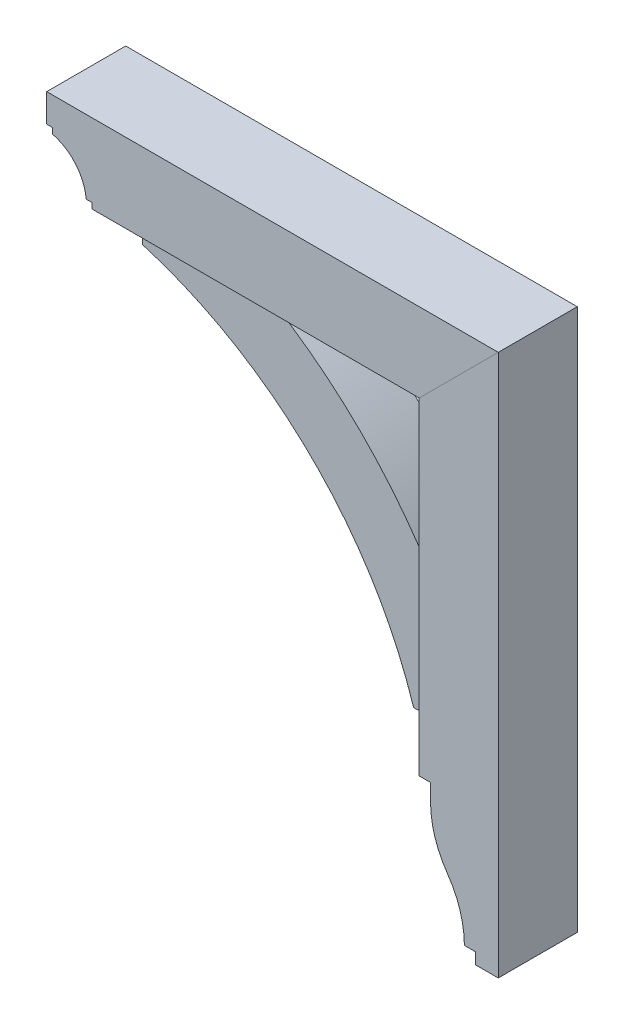
ISO-10303-21;
HEADER;
FILE_DESCRIPTION(('STEP AP214'),'2;1');
FILE_NAME('part.step','',(''),(''),'','','');
FILE_SCHEMA(('AUTOMOTIVE_DESIGN { 1 0 10303 214 1 1 1 1 }'));
ENDSEC;
DATA;
#1=APPLICATION_CONTEXT('core data for automotive mechanical design processes');
#2=APPLICATION_PROTOCOL_DEFINITION('international standard','automotive_design',2000,#1);
#3=PRODUCT_CONTEXT('',#1,'mechanical');
#4=PRODUCT('Part','Part','',(#3));
#5=PRODUCT_RELATED_PRODUCT_CATEGORY('part','',(#4));
#6=PRODUCT_DEFINITION_FORMATION('','',#4);
#7=PRODUCT_DEFINITION_CONTEXT('part definition',#1,'design');
#8=PRODUCT_DEFINITION('design','',#6,#7);
#9=PRODUCT_DEFINITION_SHAPE('','',#8);
#10=(LENGTH_UNIT() NAMED_UNIT(*) SI_UNIT(.MILLI.,.METRE.));
#11=(NAMED_UNIT(*) PLANE_ANGLE_UNIT() SI_UNIT($,.RADIAN.));
#12=(NAMED_UNIT(*) SI_UNIT($,.STERADIAN.) SOLID_ANGLE_UNIT());
#13=UNCERTAINTY_MEASURE_WITH_UNIT(LENGTH_MEASURE(1.E-05),#10,'distance_accuracy_value','');
#14=(GEOMETRIC_REPRESENTATION_CONTEXT(3) GLOBAL_UNCERTAINTY_ASSIGNED_CONTEXT((#13)) GLOBAL_UNIT_ASSIGNED_CONTEXT((#10,
#11,#12)) REPRESENTATION_CONTEXT('',''));
#15=CARTESIAN_POINT('',(0.,0.,0.));
#16=DIRECTION('',(0.,0.,1.));
#17=DIRECTION('',(1.,0.,0.));
#18=AXIS2_PLACEMENT_3D('',#15,#16,#17);
#19=CARTESIAN_POINT('',(246.881223015557,-1.43880954403931E-12,44.45));
#20=DIRECTION('',(1.,0.,0.));
#21=DIRECTION('',(0.,1.,0.));
#22=AXIS2_PLACEMENT_3D('',#19,#20,#21);
#23=PLANE('',#22);
#24=DIRECTION('',(0.,-1.,0.));
#25=VECTOR('',#24,1.);
#26=CARTESIAN_POINT('',(246.881223015557,-1.43880954403931E-12,-44.45));
#27=LINE('',#26,#25);
#28=CARTESIAN_POINT('',(246.881223015556,-183.515,-44.45));
#29=VERTEX_POINT('',#28);
#30=CARTESIAN_POINT('',(246.881223015556,-202.565,-44.45));
#31=VERTEX_POINT('',#30);
#32=EDGE_CURVE('E170',#29,#31,#27,.T.);
#33=ORIENTED_EDGE('',*,*,#32,.T.);
#34=DIRECTION('',(0.,0.,-1.));
#35=VECTOR('',#34,1.);
#36=CARTESIAN_POINT('',(246.881223015556,-202.565,44.45));
#37=LINE('',#36,#35);
#38=CARTESIAN_POINT('',(246.881223015556,-202.565,44.45));
#39=VERTEX_POINT('',#38);
#40=EDGE_CURVE('E12',#39,#31,#37,.T.);
#41=ORIENTED_EDGE('',*,*,#40,.F.);
#42=DIRECTION('',(0.,-1.,0.));
#43=VECTOR('',#42,1.);
#44=CARTESIAN_POINT('',(246.881223015557,-1.43880954403931E-12,44.45));
#45=LINE('',#44,#43);
#46=CARTESIAN_POINT('',(246.881223015556,-183.515,44.45));
#47=VERTEX_POINT('',#46);
#48=EDGE_CURVE('E203',#47,#39,#45,.T.);
#49=ORIENTED_EDGE('',*,*,#48,.F.);
#50=DIRECTION('',(0.,0.,-1.));
#51=VECTOR('',#50,1.);
#52=CARTESIAN_POINT('',(246.881223015556,-183.515,44.45));
#53=LINE('',#52,#51);
#54=EDGE_CURVE('E166',#47,#29,#53,.T.);
#55=ORIENTED_EDGE('',*,*,#54,.T.);
#56=EDGE_LOOP('',(#33,#41,#49,#55));
#57=FACE_BOUND('',#56,.T.);
#58=ADVANCED_FACE('F55',(#57),#23,.F.);
#59=CARTESIAN_POINT('',(351.656223015556,-202.565,44.45));
#60=DIRECTION('',(0.,0.,-1.));
#61=DIRECTION('',(-1.,0.,0.));
#62=AXIS2_PLACEMENT_3D('',#59,#60,#61);
#63=CYLINDRICAL_SURFACE('',#62,104.775);
#64=CARTESIAN_POINT('',(351.656223015556,-202.565,-44.45));
#65=DIRECTION('',(0.,0.,1.));
#66=DIRECTION('',(1.,0.,0.));
#67=AXIS2_PLACEMENT_3D('',#64,#65,#66);
#68=CIRCLE('',#67,104.775);
#69=CARTESIAN_POINT('',(265.883238128905,-262.738047858941,-44.45));
#70=VERTEX_POINT('',#69);
#71=EDGE_CURVE('E174',#31,#70,#68,.T.);
#72=ORIENTED_EDGE('',*,*,#71,.T.);
#73=DIRECTION('',(0.,0.,-1.));
#74=VECTOR('',#73,1.);
#75=CARTESIAN_POINT('',(265.883238128905,-262.738047858941,44.45));
#76=LINE('',#75,#74);
#77=CARTESIAN_POINT('',(265.883238128905,-262.738047858941,44.45));
#78=VERTEX_POINT('',#77);
#79=EDGE_CURVE('E64',#78,#70,#76,.T.);
#80=ORIENTED_EDGE('',*,*,#79,.F.);
#81=CARTESIAN_POINT('',(351.656223015556,-202.565,44.45));
#82=DIRECTION('',(0.,0.,1.));
#83=DIRECTION('',(1.,0.,0.));
#84=AXIS2_PLACEMENT_3D('',#81,#82,#83);
#85=CIRCLE('',#84,104.775);
#86=EDGE_CURVE('E121',#39,#78,#85,.T.);
#87=ORIENTED_EDGE('',*,*,#86,.F.);
#88=ORIENTED_EDGE('',*,*,#40,.T.);
#89=EDGE_LOOP('',(#72,#80,#87,#88));
#90=FACE_BOUND('',#89,.T.);
#91=ADVANCED_FACE('F228',(#90),#63,.T.);
#92=CARTESIAN_POINT('',(179.677056348883,-323.215,44.45));
#93=DIRECTION('',(0.,0.,-1.));
#94=DIRECTION('',(-1.,0.,0.));
#95=AXIS2_PLACEMENT_3D('',#92,#93,#94);
#96=CYLINDRICAL_SURFACE('',#95,105.304166666672);
#97=CARTESIAN_POINT('',(179.677056348883,-323.215,-44.45));
#98=DIRECTION('',(0.,0.,1.));
#99=DIRECTION('',(1.,0.,0.));
#100=AXIS2_PLACEMENT_3D('',#97,#98,#99);
#101=CIRCLE('',#100,105.304166666672);
#102=CARTESIAN_POINT('',(284.981223015555,-323.215,-44.45));
#103=VERTEX_POINT('',#102);
#104=EDGE_CURVE('E178',#103,#70,#101,.T.);
#105=ORIENTED_EDGE('',*,*,#104,.F.);
#106=DIRECTION('',(0.,0.,-1.));
#107=VECTOR('',#106,1.);
#108=CARTESIAN_POINT('',(284.981223015555,-323.215,44.45));
#109=LINE('',#108,#107);
#110=CARTESIAN_POINT('',(284.981223015555,-323.215,44.45));
#111=VERTEX_POINT('',#110);
#112=EDGE_CURVE('E219',#111,#103,#109,.T.);
#113=ORIENTED_EDGE('',*,*,#112,.F.);
#114=CARTESIAN_POINT('',(179.677056348883,-323.215,44.45));
#115=DIRECTION('',(0.,0.,1.));
#116=DIRECTION('',(1.,0.,0.));
#117=AXIS2_PLACEMENT_3D('',#114,#115,#116);
#118=CIRCLE('',#117,105.304166666672);
#119=EDGE_CURVE('E227',#111,#78,#118,.T.);
#120=ORIENTED_EDGE('',*,*,#119,.T.);
#121=ORIENTED_EDGE('',*,*,#79,.T.);
#122=EDGE_LOOP('',(#105,#113,#120,#121));
#123=FACE_BOUND('',#122,.T.);
#124=ADVANCED_FACE('F225',(#123),#96,.F.);
#125=CARTESIAN_POINT('',(0.,-323.215,44.45));
#126=DIRECTION('',(0.,-1.,0.));
#127=DIRECTION('',(0.,0.,-1.));
#128=AXIS2_PLACEMENT_3D('',#125,#126,#127);
#129=PLANE('',#128);
#130=DIRECTION('',(-1.,0.,0.));
#131=VECTOR('',#130,1.);
#132=CARTESIAN_POINT('',(0.,-323.215,-44.45));
#133=LINE('',#132,#131);
#134=CARTESIAN_POINT('',(297.681223015555,-323.215,-44.45));
#135=VERTEX_POINT('',#134);
#136=EDGE_CURVE('E182',#135,#103,#133,.T.);
#137=ORIENTED_EDGE('',*,*,#136,.F.);
#138=DIRECTION('',(0.,0.,-1.));
#139=VECTOR('',#138,1.);
#140=CARTESIAN_POINT('',(297.681223015555,-323.215,44.45));
#141=LINE('',#140,#139);
#142=CARTESIAN_POINT('',(297.681223015555,-323.215,44.45));
#143=VERTEX_POINT('',#142);
#144=EDGE_CURVE('E216',#143,#135,#141,.T.);
#145=ORIENTED_EDGE('',*,*,#144,.F.);
#146=DIRECTION('',(-1.,0.,0.));
#147=VECTOR('',#146,1.);
#148=CARTESIAN_POINT('',(0.,-323.215,44.45));
#149=LINE('',#148,#147);
#150=EDGE_CURVE('E239',#143,#111,#149,.T.);
#151=ORIENTED_EDGE('',*,*,#150,.T.);
#152=ORIENTED_EDGE('',*,*,#112,.T.);
#153=EDGE_LOOP('',(#137,#145,#151,#152));
#154=FACE_BOUND('',#153,.T.);
#155=ADVANCED_FACE('F236',(#154),#129,.T.);
#156=CARTESIAN_POINT('',(297.681223015555,0.,44.45));
#157=DIRECTION('',(-1.,0.,0.));
#158=DIRECTION('',(0.,0.,1.));
#159=AXIS2_PLACEMENT_3D('',#156,#157,#158);
#160=PLANE('',#159);
#161=DIRECTION('',(0.,1.,0.));
#162=VECTOR('',#161,1.);
#163=CARTESIAN_POINT('',(297.681223015555,0.,-44.45));
#164=LINE('',#163,#162);
#165=CARTESIAN_POINT('',(297.681223015555,-335.915,-44.45));
#166=VERTEX_POINT('',#165);
#167=EDGE_CURVE('E186',#166,#135,#164,.T.);
#168=ORIENTED_EDGE('',*,*,#167,.F.);
#169=DIRECTION('',(0.,0.,-1.));
#170=VECTOR('',#169,1.);
#171=CARTESIAN_POINT('',(297.681223015555,-335.915,44.45));
#172=LINE('',#171,#170);
#173=CARTESIAN_POINT('',(297.681223015555,-335.915,44.45));
#174=VERTEX_POINT('',#173);
#175=EDGE_CURVE('E213',#174,#166,#172,.T.);
#176=ORIENTED_EDGE('',*,*,#175,.F.);
#177=DIRECTION('',(0.,1.,0.));
#178=VECTOR('',#177,1.);
#179=CARTESIAN_POINT('',(297.681223015555,0.,44.45));
#180=LINE('',#179,#178);
#181=EDGE_CURVE('E245',#174,#143,#180,.T.);
#182=ORIENTED_EDGE('',*,*,#181,.T.);
#183=ORIENTED_EDGE('',*,*,#144,.T.);
#184=EDGE_LOOP('',(#168,#176,#182,#183));
#185=FACE_BOUND('',#184,.T.);
#186=ADVANCED_FACE('F265',(#185),#160,.T.);
#187=CARTESIAN_POINT('',(7.34134975033387E-13,-335.915000000001,44.45));
#188=DIRECTION('',(0.,-1.,0.));
#189=DIRECTION('',(1.,0.,0.));
#190=AXIS2_PLACEMENT_3D('',#187,#188,#189);
#191=PLANE('',#190);
#192=DIRECTION('',(-1.,0.,0.));
#193=VECTOR('',#192,1.);
#194=CARTESIAN_POINT('',(7.34134975033387E-13,-335.915000000001,-44.45));
#195=LINE('',#194,#193);
#196=CARTESIAN_POINT('',(323.081223015555,-335.915,-44.45));
#197=VERTEX_POINT('',#196);
#198=EDGE_CURVE('E190',#197,#166,#195,.T.);
#199=ORIENTED_EDGE('',*,*,#198,.F.);
#200=DIRECTION('',(0.,0.,-1.));
#201=VECTOR('',#200,1.);
#202=CARTESIAN_POINT('',(323.081223015555,-335.915,44.45));
#203=LINE('',#202,#201);
#204=CARTESIAN_POINT('',(323.081223015555,-335.915,44.45));
#205=VERTEX_POINT('',#204);
#206=EDGE_CURVE('E210',#205,#197,#203,.T.);
#207=ORIENTED_EDGE('',*,*,#206,.F.);
#208=DIRECTION('',(-1.,0.,0.));
#209=VECTOR('',#208,1.);
#210=CARTESIAN_POINT('',(7.34134975033387E-13,-335.915000000001,44.45));
#211=LINE('',#210,#209);
#212=EDGE_CURVE('E252',#205,#174,#211,.T.);
#213=ORIENTED_EDGE('',*,*,#212,.T.);
#214=ORIENTED_EDGE('',*,*,#175,.T.);
#215=EDGE_LOOP('',(#199,#207,#213,#214));
#216=FACE_BOUND('',#215,.T.);
#217=ADVANCED_FACE('F263',(#216),#191,.T.);
#218=CARTESIAN_POINT('',(323.081223015555,0.,44.45));
#219=DIRECTION('',(-1.,0.,0.));
#220=DIRECTION('',(0.,0.,1.));
#221=AXIS2_PLACEMENT_3D('',#218,#219,#220);
#222=PLANE('',#221);
#223=DIRECTION('',(0.,1.,0.));
#224=VECTOR('',#223,1.);
#225=CARTESIAN_POINT('',(323.081223015555,0.,-44.45));
#226=LINE('',#225,#224);
#227=CARTESIAN_POINT('',(323.081223015555,273.685,-44.45));
#228=VERTEX_POINT('',#227);
#229=EDGE_CURVE('E194',#197,#228,#226,.T.);
#230=ORIENTED_EDGE('',*,*,#229,.T.);
#231=DIRECTION('',(0.,0.,-1.));
#232=VECTOR('',#231,1.);
#233=CARTESIAN_POINT('',(323.081223015555,273.685,44.45));
#234=LINE('',#233,#232);
#235=CARTESIAN_POINT('',(323.081223015555,273.685,44.45));
#236=VERTEX_POINT('',#235);
#237=EDGE_CURVE('E158',#236,#228,#234,.T.);
#238=ORIENTED_EDGE('',*,*,#237,.F.);
#239=DIRECTION('',(0.,1.,0.));
#240=VECTOR('',#239,1.);
#241=CARTESIAN_POINT('',(323.081223015555,0.,44.45));
#242=LINE('',#241,#240);
#243=EDGE_CURVE('E147',#205,#236,#242,.T.);
#244=ORIENTED_EDGE('',*,*,#243,.F.);
#245=ORIENTED_EDGE('',*,*,#206,.T.);
#246=EDGE_LOOP('',(#230,#238,#244,#245));
#247=FACE_BOUND('',#246,.T.);
#248=ADVANCED_FACE('F272',(#247),#222,.F.);
#249=CARTESIAN_POINT('',(24.6981115077795,-24.6981115077792,44.45));
#250=DIRECTION('',(0.707106781186552,-0.707106781186543,0.));
#251=DIRECTION('',(0.707106781186543,0.707106781186552,0.));
#252=AXIS2_PLACEMENT_3D('',#249,#250,#251);
#253=PLANE('',#252);
#254=DIRECTION('',(-0.707106781186543,-0.707106781186552,0.));
#255=VECTOR('',#254,1.);
#256=CARTESIAN_POINT('',(24.6981115077795,-24.6981115077792,-44.45));
#257=LINE('',#256,#255);
#258=CARTESIAN_POINT('',(234.181223015556,184.785,-44.45));
#259=VERTEX_POINT('',#258);
#260=EDGE_CURVE('E156',#228,#259,#257,.T.);
#261=ORIENTED_EDGE('',*,*,#260,.T.);
#262=DIRECTION('',(0.,0.,-1.));
#263=VECTOR('',#262,1.);
#264=CARTESIAN_POINT('',(234.181223015556,184.785,44.45));
#265=LINE('',#264,#263);
#266=CARTESIAN_POINT('',(234.181223015556,184.785,44.45));
#267=VERTEX_POINT('',#266);
#268=EDGE_CURVE('E153',#267,#259,#265,.T.);
#269=ORIENTED_EDGE('',*,*,#268,.F.);
#270=DIRECTION('',(-0.707106781186543,-0.707106781186552,0.));
#271=VECTOR('',#270,1.);
#272=CARTESIAN_POINT('',(24.6981115077795,-24.6981115077792,44.45));
#273=LINE('',#272,#271);
#274=EDGE_CURVE('E140',#236,#267,#273,.T.);
#275=ORIENTED_EDGE('',*,*,#274,.F.);
#276=ORIENTED_EDGE('',*,*,#237,.T.);
#277=EDGE_LOOP('',(#261,#269,#275,#276));
#278=FACE_BOUND('',#277,.T.);
#279=ADVANCED_FACE('F154',(#278),#253,.F.);
#280=CARTESIAN_POINT('',(234.181223015556,0.,44.45));
#281=DIRECTION('',(1.,0.,0.));
#282=DIRECTION('',(0.,1.,0.));
#283=AXIS2_PLACEMENT_3D('',#280,#281,#282);
#284=PLANE('',#283);
#285=DIRECTION('',(0.,-1.,0.));
#286=VECTOR('',#285,1.);
#287=CARTESIAN_POINT('',(234.181223015556,0.,-44.45));
#288=LINE('',#287,#286);
#289=CARTESIAN_POINT('',(234.181223015556,-183.515,-44.45));
#290=VERTEX_POINT('',#289);
#291=EDGE_CURVE('E107',#259,#290,#288,.T.);
#292=ORIENTED_EDGE('',*,*,#291,.T.);
#293=DIRECTION('',(0.,0.,-1.));
#294=VECTOR('',#293,1.);
#295=CARTESIAN_POINT('',(234.181223015556,-183.515,44.45));
#296=LINE('',#295,#294);
#297=CARTESIAN_POINT('',(234.181223015556,-183.515,44.45));
#298=VERTEX_POINT('',#297);
#299=EDGE_CURVE('E159',#298,#290,#296,.T.);
#300=ORIENTED_EDGE('',*,*,#299,.F.);
#301=DIRECTION('',(0.,-1.,0.));
#302=VECTOR('',#301,1.);
#303=CARTESIAN_POINT('',(234.181223015556,0.,44.45));
#304=LINE('',#303,#302);
#305=EDGE_CURVE('E144',#267,#298,#304,.T.);
#306=ORIENTED_EDGE('',*,*,#305,.F.);
#307=ORIENTED_EDGE('',*,*,#268,.T.);
#308=EDGE_LOOP('',(#292,#300,#306,#307));
#309=FACE_BOUND('',#308,.T.);
#310=ADVANCED_FACE('F161',(#309),#284,.F.);
#311=CARTESIAN_POINT('',(0.,-183.515,44.45));
#312=DIRECTION('',(0.,1.,0.));
#313=DIRECTION('',(0.,0.,1.));
#314=AXIS2_PLACEMENT_3D('',#311,#312,#313);
#315=PLANE('',#314);
#316=DIRECTION('',(1.,0.,0.));
#317=VECTOR('',#316,1.);
#318=CARTESIAN_POINT('',(0.,-183.515,-44.45));
#319=LINE('',#318,#317);
#320=EDGE_CURVE('E113',#290,#29,#319,.T.);
#321=ORIENTED_EDGE('',*,*,#320,.T.);
#322=ORIENTED_EDGE('',*,*,#54,.F.);
#323=DIRECTION('',(1.,0.,0.));
#324=VECTOR('',#323,1.);
#325=CARTESIAN_POINT('',(0.,-183.515,44.45));
#326=LINE('',#325,#324);
#327=EDGE_CURVE('E72',#298,#47,#326,.T.);
#328=ORIENTED_EDGE('',*,*,#327,.F.);
#329=ORIENTED_EDGE('',*,*,#299,.T.);
#330=EDGE_LOOP('',(#321,#322,#328,#329));
#331=FACE_BOUND('',#330,.T.);
#332=ADVANCED_FACE('F317',(#331),#315,.F.);
#333=CARTESIAN_POINT('',(0.,0.,44.45));
#334=DIRECTION('',(0.,0.,1.));
#335=DIRECTION('',(1.,0.,0.));
#336=AXIS2_PLACEMENT_3D('',#333,#334,#335);
#337=PLANE('',#336);
#338=ORIENTED_EDGE('',*,*,#48,.T.);
#339=ORIENTED_EDGE('',*,*,#86,.T.);
#340=ORIENTED_EDGE('',*,*,#119,.F.);
#341=ORIENTED_EDGE('',*,*,#150,.F.);
#342=ORIENTED_EDGE('',*,*,#181,.F.);
#343=ORIENTED_EDGE('',*,*,#212,.F.);
#344=ORIENTED_EDGE('',*,*,#243,.T.);
#345=ORIENTED_EDGE('',*,*,#274,.T.);
#346=ORIENTED_EDGE('',*,*,#305,.T.);
#347=ORIENTED_EDGE('',*,*,#327,.T.);
#348=EDGE_LOOP('',(#338,#339,#340,#341,#342,#343,#344,#345,#346,#347));
#349=FACE_BOUND('',#348,.T.);
#350=ADVANCED_FACE('F142',(#349),#337,.T.);
#351=CARTESIAN_POINT('',(0.,0.,-44.45));
#352=DIRECTION('',(0.,0.,1.));
#353=DIRECTION('',(1.,0.,0.));
#354=AXIS2_PLACEMENT_3D('',#351,#352,#353);
#355=PLANE('',#354);
#356=ORIENTED_EDGE('',*,*,#32,.F.);
#357=ORIENTED_EDGE('',*,*,#320,.F.);
#358=ORIENTED_EDGE('',*,*,#291,.F.);
#359=ORIENTED_EDGE('',*,*,#260,.F.);
#360=ORIENTED_EDGE('',*,*,#229,.F.);
#361=ORIENTED_EDGE('',*,*,#198,.T.);
#362=ORIENTED_EDGE('',*,*,#167,.T.);
#363=ORIENTED_EDGE('',*,*,#136,.T.);
#364=ORIENTED_EDGE('',*,*,#104,.T.);
#365=ORIENTED_EDGE('',*,*,#71,.F.);
#366=EDGE_LOOP('',(#356,#357,#358,#359,#360,#361,#362,#363,#364,#365));
#367=FACE_BOUND('',#366,.T.);
#368=ADVANCED_FACE('F232',(#367),#355,.F.);
#369=CLOSED_SHELL('',(#58,#91,#124,#155,#186,#217,#248,#279,#310,#332,#350,#368));
#370=MANIFOLD_SOLID_BREP('B2',#369);
#371=CARTESIAN_POINT('',(-220.410616025048,-272.271107692752,31.75));
#372=DIRECTION('',(0.,0.,-1.));
#373=DIRECTION('',(-1.,0.,0.));
#374=AXIS2_PLACEMENT_3D('',#371,#372,#373);
#375=CYLINDRICAL_SURFACE('',#374,533.514492592305);
#376=CARTESIAN_POINT('',(-220.410616025048,-272.271107692752,-31.75));
#377=DIRECTION('',(0.,0.,1.));
#378=DIRECTION('',(1.,0.,0.));
#379=AXIS2_PLACEMENT_3D('',#376,#377,#378);
#380=CIRCLE('',#379,533.514492592305);
#381=CARTESIAN_POINT('',(54.7937230155559,184.785,-31.75));
#382=VERTEX_POINT('',#381);
#383=CARTESIAN_POINT('',(234.181223015556,6.98499999999996,-31.75));
#384=VERTEX_POINT('',#383);
#385=EDGE_CURVE('E474',#382,#384,#380,.F.);
#386=ORIENTED_EDGE('',*,*,#385,.F.);
#387=DIRECTION('',(0.,0.,-1.));
#388=VECTOR('',#387,1.);
#389=CARTESIAN_POINT('',(54.7937230155559,184.785,31.75));
#390=LINE('',#389,#388);
#391=CARTESIAN_POINT('',(54.7937230155559,184.785,31.75));
#392=VERTEX_POINT('',#391);
#393=EDGE_CURVE('E53',#392,#382,#390,.T.);
#394=ORIENTED_EDGE('',*,*,#393,.F.);
#395=CARTESIAN_POINT('',(-220.410616025048,-272.271107692752,31.75));
#396=DIRECTION('',(0.,0.,1.));
#397=DIRECTION('',(1.,0.,0.));
#398=AXIS2_PLACEMENT_3D('',#395,#396,#397);
#399=CIRCLE('',#398,533.514492592305);
#400=CARTESIAN_POINT('',(234.181223015556,6.98499999999996,31.75));
#401=VERTEX_POINT('',#400);
#402=EDGE_CURVE('E492',#392,#401,#399,.F.);
#403=ORIENTED_EDGE('',*,*,#402,.T.);
#404=DIRECTION('',(0.,0.,-1.));
#405=VECTOR('',#404,1.);
#406=CARTESIAN_POINT('',(234.181223015556,6.98499999999996,31.75));
#407=LINE('',#406,#405);
#408=EDGE_CURVE('E402',#401,#384,#407,.T.);
#409=ORIENTED_EDGE('',*,*,#408,.T.);
#410=EDGE_LOOP('',(#386,#394,#403,#409));
#411=FACE_BOUND('',#410,.T.);
#412=ADVANCED_FACE('F385',(#411),#375,.T.);
#413=CARTESIAN_POINT('',(0.,184.785,31.75));
#414=DIRECTION('',(0.,1.,0.));
#415=DIRECTION('',(0.,0.,1.));
#416=AXIS2_PLACEMENT_3D('',#413,#414,#415);
#417=PLANE('',#416);
#418=DIRECTION('',(1.,0.,0.));
#419=VECTOR('',#418,1.);
#420=CARTESIAN_POINT('',(0.,184.785,-31.75));
#421=LINE('',#420,#419);
#422=CARTESIAN_POINT('',(-89.6687769844451,184.785,-31.75));
#423=VERTEX_POINT('',#422);
#424=EDGE_CURVE('E477',#423,#382,#421,.T.);
#425=ORIENTED_EDGE('',*,*,#424,.F.);
#426=DIRECTION('',(0.,0.,-1.));
#427=VECTOR('',#426,1.);
#428=CARTESIAN_POINT('',(-89.6687769844451,184.785,31.75));
#429=LINE('',#428,#427);
#430=CARTESIAN_POINT('',(-89.6687769844451,184.785,31.75));
#431=VERTEX_POINT('',#430);
#432=EDGE_CURVE('E394',#431,#423,#429,.T.);
#433=ORIENTED_EDGE('',*,*,#432,.F.);
#434=DIRECTION('',(1.,0.,0.));
#435=VECTOR('',#434,1.);
#436=CARTESIAN_POINT('',(0.,184.785,31.75));
#437=LINE('',#436,#435);
#438=EDGE_CURVE('E508',#431,#392,#437,.T.);
#439=ORIENTED_EDGE('',*,*,#438,.T.);
#440=ORIENTED_EDGE('',*,*,#393,.T.);
#441=EDGE_LOOP('',(#425,#433,#439,#440));
#442=FACE_BOUND('',#441,.T.);
#443=ADVANCED_FACE('F507',(#442),#417,.T.);
#444=CARTESIAN_POINT('',(-89.6687769844453,0.,31.75));
#445=DIRECTION('',(1.,0.,0.));
#446=DIRECTION('',(0.,1.,0.));
#447=AXIS2_PLACEMENT_3D('',#444,#445,#446);
#448=PLANE('',#447);
#449=DIRECTION('',(0.,-1.,0.));
#450=VECTOR('',#449,1.);
#451=CARTESIAN_POINT('',(-89.6687769844453,0.,-31.75));
#452=LINE('',#451,#450);
#453=CARTESIAN_POINT('',(-89.6687769844452,165.735,-31.75));
#454=VERTEX_POINT('',#453);
#455=EDGE_CURVE('E481',#423,#454,#452,.T.);
#456=ORIENTED_EDGE('',*,*,#455,.T.);
#457=DIRECTION('',(0.,0.,-1.));
#458=VECTOR('',#457,1.);
#459=CARTESIAN_POINT('',(-89.6687769844452,165.735,31.75));
#460=LINE('',#459,#458);
#461=CARTESIAN_POINT('',(-89.6687769844452,165.735,31.75));
#462=VERTEX_POINT('',#461);
#463=EDGE_CURVE('E462',#462,#454,#460,.T.);
#464=ORIENTED_EDGE('',*,*,#463,.F.);
#465=DIRECTION('',(0.,-1.,0.));
#466=VECTOR('',#465,1.);
#467=CARTESIAN_POINT('',(-89.6687769844453,0.,31.75));
#468=LINE('',#467,#466);
#469=EDGE_CURVE('E448',#431,#462,#468,.T.);
#470=ORIENTED_EDGE('',*,*,#469,.F.);
#471=ORIENTED_EDGE('',*,*,#432,.T.);
#472=EDGE_LOOP('',(#456,#464,#470,#471));
#473=FACE_BOUND('',#472,.T.);
#474=ADVANCED_FACE('F501',(#473),#448,.F.);
#475=CARTESIAN_POINT('',(-220.195848850223,-272.436796799094,31.75));
#476=DIRECTION('',(0.,0.,-1.));
#477=DIRECTION('',(-1.,0.,0.));
#478=AXIS2_PLACEMENT_3D('',#475,#476,#477);
#479=CYLINDRICAL_SURFACE('',#478,457.2);
#480=CARTESIAN_POINT('',(-220.195848850223,-272.436796799094,-31.75));
#481=DIRECTION('',(0.,0.,1.));
#482=DIRECTION('',(1.,0.,0.));
#483=AXIS2_PLACEMENT_3D('',#480,#481,#482);
#484=CIRCLE('',#483,457.2);
#485=CARTESIAN_POINT('',(215.131223015556,-132.715,-31.75));
#486=VERTEX_POINT('',#485);
#487=EDGE_CURVE('E458',#454,#486,#484,.F.);
#488=ORIENTED_EDGE('',*,*,#487,.T.);
#489=DIRECTION('',(0.,0.,-1.));
#490=VECTOR('',#489,1.);
#491=CARTESIAN_POINT('',(215.131223015556,-132.715,31.75));
#492=LINE('',#491,#490);
#493=CARTESIAN_POINT('',(215.131223015556,-132.715,31.75));
#494=VERTEX_POINT('',#493);
#495=EDGE_CURVE('E455',#494,#486,#492,.T.);
#496=ORIENTED_EDGE('',*,*,#495,.F.);
#497=CARTESIAN_POINT('',(-220.195848850223,-272.436796799094,31.75));
#498=DIRECTION('',(0.,0.,1.));
#499=DIRECTION('',(1.,0.,0.));
#500=AXIS2_PLACEMENT_3D('',#497,#498,#499);
#501=CIRCLE('',#500,457.2);
#502=EDGE_CURVE('E440',#462,#494,#501,.F.);
#503=ORIENTED_EDGE('',*,*,#502,.F.);
#504=ORIENTED_EDGE('',*,*,#463,.T.);
#505=EDGE_LOOP('',(#488,#496,#503,#504));
#506=FACE_BOUND('',#505,.T.);
#507=ADVANCED_FACE('F456',(#506),#479,.F.);
#508=CARTESIAN_POINT('',(0.,-132.715,31.75));
#509=DIRECTION('',(0.,-1.,0.));
#510=DIRECTION('',(0.,0.,-1.));
#511=AXIS2_PLACEMENT_3D('',#508,#509,#510);
#512=PLANE('',#511);
#513=DIRECTION('',(-1.,0.,0.));
#514=VECTOR('',#513,1.);
#515=CARTESIAN_POINT('',(0.,-132.715,-31.75));
#516=LINE('',#515,#514);
#517=CARTESIAN_POINT('',(234.181223015556,-132.715,-31.75));
#518=VERTEX_POINT('',#517);
#519=EDGE_CURVE('E485',#518,#486,#516,.T.);
#520=ORIENTED_EDGE('',*,*,#519,.F.);
#521=DIRECTION('',(0.,0.,-1.));
#522=VECTOR('',#521,1.);
#523=CARTESIAN_POINT('',(234.181223015556,-132.715,31.75));
#524=LINE('',#523,#522);
#525=CARTESIAN_POINT('',(234.181223015556,-132.715,31.75));
#526=VERTEX_POINT('',#525);
#527=EDGE_CURVE('E421',#526,#518,#524,.T.);
#528=ORIENTED_EDGE('',*,*,#527,.F.);
#529=DIRECTION('',(-1.,0.,0.));
#530=VECTOR('',#529,1.);
#531=CARTESIAN_POINT('',(0.,-132.715,31.75));
#532=LINE('',#531,#530);
#533=EDGE_CURVE('E445',#526,#494,#532,.T.);
#534=ORIENTED_EDGE('',*,*,#533,.T.);
#535=ORIENTED_EDGE('',*,*,#495,.T.);
#536=EDGE_LOOP('',(#520,#528,#534,#535));
#537=FACE_BOUND('',#536,.T.);
#538=ADVANCED_FACE('F464',(#537),#512,.T.);
#539=CARTESIAN_POINT('',(234.181223015556,0.,31.75));
#540=DIRECTION('',(1.,0.,0.));
#541=DIRECTION('',(0.,1.,0.));
#542=AXIS2_PLACEMENT_3D('',#539,#540,#541);
#543=PLANE('',#542);
#544=DIRECTION('',(0.,-1.,0.));
#545=VECTOR('',#544,1.);
#546=CARTESIAN_POINT('',(234.181223015556,0.,-31.75));
#547=LINE('',#546,#545);
#548=EDGE_CURVE('E488',#384,#518,#547,.T.);
#549=ORIENTED_EDGE('',*,*,#548,.F.);
#550=ORIENTED_EDGE('',*,*,#408,.F.);
#551=DIRECTION('',(0.,-1.,0.));
#552=VECTOR('',#551,1.);
#553=CARTESIAN_POINT('',(234.181223015556,0.,31.75));
#554=LINE('',#553,#552);
#555=EDGE_CURVE('E466',#401,#526,#554,.T.);
#556=ORIENTED_EDGE('',*,*,#555,.T.);
#557=ORIENTED_EDGE('',*,*,#527,.T.);
#558=EDGE_LOOP('',(#549,#550,#556,#557));
#559=FACE_BOUND('',#558,.T.);
#560=ADVANCED_FACE('F509',(#559),#543,.T.);
#561=CARTESIAN_POINT('',(0.,0.,31.75));
#562=DIRECTION('',(0.,0.,1.));
#563=DIRECTION('',(1.,0.,0.));
#564=AXIS2_PLACEMENT_3D('',#561,#562,#563);
#565=PLANE('',#564);
#566=ORIENTED_EDGE('',*,*,#402,.F.);
#567=ORIENTED_EDGE('',*,*,#438,.F.);
#568=ORIENTED_EDGE('',*,*,#469,.T.);
#569=ORIENTED_EDGE('',*,*,#502,.T.);
#570=ORIENTED_EDGE('',*,*,#533,.F.);
#571=ORIENTED_EDGE('',*,*,#555,.F.);
#572=EDGE_LOOP('',(#566,#567,#568,#569,#570,#571));
#573=FACE_BOUND('',#572,.T.);
#574=ADVANCED_FACE('F442',(#573),#565,.T.);
#575=CARTESIAN_POINT('',(0.,0.,-31.75));
#576=DIRECTION('',(0.,0.,1.));
#577=DIRECTION('',(1.,0.,0.));
#578=AXIS2_PLACEMENT_3D('',#575,#576,#577);
#579=PLANE('',#578);
#580=ORIENTED_EDGE('',*,*,#385,.T.);
#581=ORIENTED_EDGE('',*,*,#548,.T.);
#582=ORIENTED_EDGE('',*,*,#519,.T.);
#583=ORIENTED_EDGE('',*,*,#487,.F.);
#584=ORIENTED_EDGE('',*,*,#455,.F.);
#585=ORIENTED_EDGE('',*,*,#424,.T.);
#586=EDGE_LOOP('',(#580,#581,#582,#583,#584,#585));
#587=FACE_BOUND('',#586,.T.);
#588=ADVANCED_FACE('F506',(#587),#579,.F.);
#589=CLOSED_SHELL('',(#412,#443,#474,#507,#538,#560,#574,#588));
#590=MANIFOLD_SOLID_BREP('B6',#589);
#591=CARTESIAN_POINT('',(-178.568776984445,0.,44.45));
#592=DIRECTION('',(-1.,0.,0.));
#593=DIRECTION('',(0.,0.,1.));
#594=AXIS2_PLACEMENT_3D('',#591,#592,#593);
#595=PLANE('',#594);
#596=DIRECTION('',(0.,1.,0.));
#597=VECTOR('',#596,1.);
#598=CARTESIAN_POINT('',(-178.568776984445,0.,-44.45));
#599=LINE('',#598,#597);
#600=CARTESIAN_POINT('',(-178.568776984445,235.585,-44.45));
#601=VERTEX_POINT('',#600);
#602=CARTESIAN_POINT('',(-178.568776984445,241.935,-44.45));
#603=VERTEX_POINT('',#602);
#604=EDGE_CURVE('E692',#601,#603,#599,.T.);
#605=ORIENTED_EDGE('',*,*,#604,.F.);
#606=DIRECTION('',(0.,0.,-1.));
#607=VECTOR('',#606,1.);
#608=CARTESIAN_POINT('',(-178.568776984445,235.585,44.45));
#609=LINE('',#608,#607);
#610=CARTESIAN_POINT('',(-178.568776984445,235.585,44.45));
#611=VERTEX_POINT('',#610);
#612=EDGE_CURVE('E383',#611,#601,#609,.T.);
#613=ORIENTED_EDGE('',*,*,#612,.F.);
#614=DIRECTION('',(0.,1.,0.));
#615=VECTOR('',#614,1.);
#616=CARTESIAN_POINT('',(-178.568776984445,0.,44.45));
#617=LINE('',#616,#615);
#618=CARTESIAN_POINT('',(-178.568776984445,241.935,44.45));
#619=VERTEX_POINT('',#618);
#620=EDGE_CURVE('E724',#611,#619,#617,.T.);
#621=ORIENTED_EDGE('',*,*,#620,.T.);
#622=DIRECTION('',(0.,0.,-1.));
#623=VECTOR('',#622,1.);
#624=CARTESIAN_POINT('',(-178.568776984445,241.935,44.45));
#625=LINE('',#624,#623);
#626=EDGE_CURVE('E603',#619,#603,#625,.T.);
#627=ORIENTED_EDGE('',*,*,#626,.T.);
#628=EDGE_LOOP('',(#605,#613,#621,#627));
#629=FACE_BOUND('',#628,.T.);
#630=ADVANCED_FACE('F586',(#629),#595,.T.);
#631=CARTESIAN_POINT('',(-190.980101736884,186.393150212196,44.45));
#632=DIRECTION('',(0.,0.,-1.));
#633=DIRECTION('',(-1.,0.,0.));
#634=AXIS2_PLACEMENT_3D('',#631,#632,#633);
#635=CYLINDRICAL_SURFACE('',#634,50.7334117486338);
#636=CARTESIAN_POINT('',(-190.980101736884,186.393150212196,-44.45));
#637=DIRECTION('',(0.,0.,1.));
#638=DIRECTION('',(1.,0.,0.));
#639=AXIS2_PLACEMENT_3D('',#636,#637,#638);
#640=CIRCLE('',#639,50.7334117486338);
#641=CARTESIAN_POINT('',(-140.468776984445,191.135,-44.45));
#642=VERTEX_POINT('',#641);
#643=EDGE_CURVE('E695',#601,#642,#640,.F.);
#644=ORIENTED_EDGE('',*,*,#643,.T.);
#645=DIRECTION('',(0.,0.,-1.));
#646=VECTOR('',#645,1.);
#647=CARTESIAN_POINT('',(-140.468776984445,191.135,44.45));
#648=LINE('',#647,#646);
#649=CARTESIAN_POINT('',(-140.468776984445,191.135,44.45));
#650=VERTEX_POINT('',#649);
#651=EDGE_CURVE('E595',#650,#642,#648,.T.);
#652=ORIENTED_EDGE('',*,*,#651,.F.);
#653=CARTESIAN_POINT('',(-190.980101736884,186.393150212196,44.45));
#654=DIRECTION('',(0.,0.,1.));
#655=DIRECTION('',(1.,0.,0.));
#656=AXIS2_PLACEMENT_3D('',#653,#654,#655);
#657=CIRCLE('',#656,50.7334117486338);
#658=EDGE_CURVE('E759',#611,#650,#657,.F.);
#659=ORIENTED_EDGE('',*,*,#658,.F.);
#660=ORIENTED_EDGE('',*,*,#612,.T.);
#661=EDGE_LOOP('',(#644,#652,#659,#660));
#662=FACE_BOUND('',#661,.T.);
#663=ADVANCED_FACE('F748',(#662),#635,.F.);
#664=CARTESIAN_POINT('',(-1.67088565206086E-12,191.135000000001,44.45));
#665=DIRECTION('',(0.,-1.,0.));
#666=DIRECTION('',(1.,0.,0.));
#667=AXIS2_PLACEMENT_3D('',#664,#665,#666);
#668=PLANE('',#667);
#669=DIRECTION('',(-1.,0.,0.));
#670=VECTOR('',#669,1.);
#671=CARTESIAN_POINT('',(-1.67088565206086E-12,191.135000000001,-44.45));
#672=LINE('',#671,#670);
#673=CARTESIAN_POINT('',(-134.118776984445,191.135,-44.45));
#674=VERTEX_POINT('',#673);
#675=EDGE_CURVE('E699',#674,#642,#672,.T.);
#676=ORIENTED_EDGE('',*,*,#675,.F.);
#677=DIRECTION('',(0.,0.,-1.));
#678=VECTOR('',#677,1.);
#679=CARTESIAN_POINT('',(-134.118776984445,191.135,44.45));
#680=LINE('',#679,#678);
#681=CARTESIAN_POINT('',(-134.118776984445,191.135,44.45));
#682=VERTEX_POINT('',#681);
#683=EDGE_CURVE('E737',#682,#674,#680,.T.);
#684=ORIENTED_EDGE('',*,*,#683,.F.);
#685=DIRECTION('',(-1.,0.,0.));
#686=VECTOR('',#685,1.);
#687=CARTESIAN_POINT('',(-1.67088565206086E-12,191.135000000001,44.45));
#688=LINE('',#687,#686);
#689=EDGE_CURVE('E745',#682,#650,#688,.T.);
#690=ORIENTED_EDGE('',*,*,#689,.T.);
#691=ORIENTED_EDGE('',*,*,#651,.T.);
#692=EDGE_LOOP('',(#676,#684,#690,#691));
#693=FACE_BOUND('',#692,.T.);
#694=ADVANCED_FACE('F743',(#693),#668,.T.);
#695=CARTESIAN_POINT('',(-134.118776984445,0.,44.45));
#696=DIRECTION('',(-1.,0.,0.));
#697=DIRECTION('',(0.,0.,1.));
#698=AXIS2_PLACEMENT_3D('',#695,#696,#697);
#699=PLANE('',#698);
#700=DIRECTION('',(0.,1.,0.));
#701=VECTOR('',#700,1.);
#702=CARTESIAN_POINT('',(-134.118776984445,0.,-44.45));
#703=LINE('',#702,#701);
#704=CARTESIAN_POINT('',(-134.118776984445,184.785,-44.45));
#705=VERTEX_POINT('',#704);
#706=EDGE_CURVE('E703',#705,#674,#703,.T.);
#707=ORIENTED_EDGE('',*,*,#706,.F.);
#708=DIRECTION('',(0.,0.,-1.));
#709=VECTOR('',#708,1.);
#710=CARTESIAN_POINT('',(-134.118776984445,184.785,44.45));
#711=LINE('',#710,#709);
#712=CARTESIAN_POINT('',(-134.118776984445,184.785,44.45));
#713=VERTEX_POINT('',#712);
#714=EDGE_CURVE('E734',#713,#705,#711,.T.);
#715=ORIENTED_EDGE('',*,*,#714,.F.);
#716=DIRECTION('',(0.,1.,0.));
#717=VECTOR('',#716,1.);
#718=CARTESIAN_POINT('',(-134.118776984445,0.,44.45));
#719=LINE('',#718,#717);
#720=EDGE_CURVE('E758',#713,#682,#719,.T.);
#721=ORIENTED_EDGE('',*,*,#720,.T.);
#722=ORIENTED_EDGE('',*,*,#683,.T.);
#723=EDGE_LOOP('',(#707,#715,#721,#722));
#724=FACE_BOUND('',#723,.T.);
#725=ADVANCED_FACE('F754',(#724),#699,.T.);
#726=CARTESIAN_POINT('',(0.,184.785,44.45));
#727=DIRECTION('',(0.,1.,0.));
#728=DIRECTION('',(0.,0.,1.));
#729=AXIS2_PLACEMENT_3D('',#726,#727,#728);
#730=PLANE('',#729);
#731=DIRECTION('',(1.,0.,0.));
#732=VECTOR('',#731,1.);
#733=CARTESIAN_POINT('',(0.,184.785,-44.45));
#734=LINE('',#733,#732);
#735=CARTESIAN_POINT('',(234.181223015556,184.785,-44.45));
#736=VERTEX_POINT('',#735);
#737=EDGE_CURVE('E707',#705,#736,#734,.T.);
#738=ORIENTED_EDGE('',*,*,#737,.T.);
#739=DIRECTION('',(0.,0.,-1.));
#740=VECTOR('',#739,1.);
#741=CARTESIAN_POINT('',(234.181223015556,184.785,44.45));
#742=LINE('',#741,#740);
#743=CARTESIAN_POINT('',(234.181223015556,184.785,44.45));
#744=VERTEX_POINT('',#743);
#745=EDGE_CURVE('E731',#744,#736,#742,.T.);
#746=ORIENTED_EDGE('',*,*,#745,.F.);
#747=DIRECTION('',(1.,0.,0.));
#748=VECTOR('',#747,1.);
#749=CARTESIAN_POINT('',(0.,184.785,44.45));
#750=LINE('',#749,#748);
#751=EDGE_CURVE('E762',#713,#744,#750,.T.);
#752=ORIENTED_EDGE('',*,*,#751,.F.);
#753=ORIENTED_EDGE('',*,*,#714,.T.);
#754=EDGE_LOOP('',(#738,#746,#752,#753));
#755=FACE_BOUND('',#754,.T.);
#756=ADVANCED_FACE('F795',(#755),#730,.F.);
#757=CARTESIAN_POINT('',(24.6981115077795,-24.6981115077792,44.45));
#758=DIRECTION('',(0.707106781186552,-0.707106781186543,0.));
#759=DIRECTION('',(0.707106781186543,0.707106781186552,0.));
#760=AXIS2_PLACEMENT_3D('',#757,#758,#759);
#761=PLANE('',#760);
#762=DIRECTION('',(-0.707106781186543,-0.707106781186552,0.));
#763=VECTOR('',#762,1.);
#764=CARTESIAN_POINT('',(24.6981115077795,-24.6981115077792,-44.45));
#765=LINE('',#764,#763);
#766=CARTESIAN_POINT('',(323.081223015555,273.685,-44.45));
#767=VERTEX_POINT('',#766);
#768=EDGE_CURVE('E711',#767,#736,#765,.T.);
#769=ORIENTED_EDGE('',*,*,#768,.F.);
#770=DIRECTION('',(0.,0.,-1.));
#771=VECTOR('',#770,1.);
#772=CARTESIAN_POINT('',(323.081223015555,273.685,44.45));
#773=LINE('',#772,#771);
#774=CARTESIAN_POINT('',(323.081223015555,273.685,44.45));
#775=VERTEX_POINT('',#774);
#776=EDGE_CURVE('E680',#775,#767,#773,.T.);
#777=ORIENTED_EDGE('',*,*,#776,.F.);
#778=DIRECTION('',(-0.707106781186543,-0.707106781186552,0.));
#779=VECTOR('',#778,1.);
#780=CARTESIAN_POINT('',(24.6981115077795,-24.6981115077792,44.45));
#781=LINE('',#780,#779);
#782=EDGE_CURVE('E668',#775,#744,#781,.T.);
#783=ORIENTED_EDGE('',*,*,#782,.T.);
#784=ORIENTED_EDGE('',*,*,#745,.T.);
#785=EDGE_LOOP('',(#769,#777,#783,#784));
#786=FACE_BOUND('',#785,.T.);
#787=ADVANCED_FACE('F772',(#786),#761,.T.);
#788=CARTESIAN_POINT('',(0.,273.685,44.45));
#789=DIRECTION('',(0.,-1.,0.));
#790=DIRECTION('',(0.,0.,-1.));
#791=AXIS2_PLACEMENT_3D('',#788,#789,#790);
#792=PLANE('',#791);
#793=DIRECTION('',(-1.,0.,0.));
#794=VECTOR('',#793,1.);
#795=CARTESIAN_POINT('',(0.,273.685,-44.45));
#796=LINE('',#795,#794);
#797=CARTESIAN_POINT('',(-184.918776984445,273.685,-44.45));
#798=VERTEX_POINT('',#797);
#799=EDGE_CURVE('E676',#767,#798,#796,.T.);
#800=ORIENTED_EDGE('',*,*,#799,.T.);
#801=DIRECTION('',(0.,0.,-1.));
#802=VECTOR('',#801,1.);
#803=CARTESIAN_POINT('',(-184.918776984445,273.685,44.45));
#804=LINE('',#803,#802);
#805=CARTESIAN_POINT('',(-184.918776984445,273.685,44.45));
#806=VERTEX_POINT('',#805);
#807=EDGE_CURVE('E673',#806,#798,#804,.T.);
#808=ORIENTED_EDGE('',*,*,#807,.F.);
#809=DIRECTION('',(-1.,0.,0.));
#810=VECTOR('',#809,1.);
#811=CARTESIAN_POINT('',(0.,273.685,44.45));
#812=LINE('',#811,#810);
#813=EDGE_CURVE('E660',#775,#806,#812,.T.);
#814=ORIENTED_EDGE('',*,*,#813,.F.);
#815=ORIENTED_EDGE('',*,*,#776,.T.);
#816=EDGE_LOOP('',(#800,#808,#814,#815));
#817=FACE_BOUND('',#816,.T.);
#818=ADVANCED_FACE('F674',(#817),#792,.F.);
#819=CARTESIAN_POINT('',(-184.918776984445,0.,44.45));
#820=DIRECTION('',(1.,0.,0.));
#821=DIRECTION('',(0.,0.,-1.));
#822=AXIS2_PLACEMENT_3D('',#819,#820,#821);
#823=PLANE('',#822);
#824=DIRECTION('',(0.,-1.,0.));
#825=VECTOR('',#824,1.);
#826=CARTESIAN_POINT('',(-184.918776984445,0.,-44.45));
#827=LINE('',#826,#825);
#828=CARTESIAN_POINT('',(-184.918776984445,241.935,-44.45));
#829=VERTEX_POINT('',#828);
#830=EDGE_CURVE('E717',#798,#829,#827,.T.);
#831=ORIENTED_EDGE('',*,*,#830,.T.);
#832=DIRECTION('',(0.,0.,-1.));
#833=VECTOR('',#832,1.);
#834=CARTESIAN_POINT('',(-184.918776984445,241.935,44.45));
#835=LINE('',#834,#833);
#836=CARTESIAN_POINT('',(-184.918776984445,241.935,44.45));
#837=VERTEX_POINT('',#836);
#838=EDGE_CURVE('E632',#837,#829,#835,.T.);
#839=ORIENTED_EDGE('',*,*,#838,.F.);
#840=DIRECTION('',(0.,-1.,0.));
#841=VECTOR('',#840,1.);
#842=CARTESIAN_POINT('',(-184.918776984445,0.,44.45));
#843=LINE('',#842,#841);
#844=EDGE_CURVE('E666',#806,#837,#843,.T.);
#845=ORIENTED_EDGE('',*,*,#844,.F.);
#846=ORIENTED_EDGE('',*,*,#807,.T.);
#847=EDGE_LOOP('',(#831,#839,#845,#846));
#848=FACE_BOUND('',#847,.T.);
#849=ADVANCED_FACE('F682',(#848),#823,.F.);
#850=CARTESIAN_POINT('',(2.11497486191092E-12,241.934999999998,44.45));
#851=DIRECTION('',(0.,-1.,0.));
#852=DIRECTION('',(1.,0.,0.));
#853=AXIS2_PLACEMENT_3D('',#850,#851,#852);
#854=PLANE('',#853);
#855=DIRECTION('',(-1.,0.,0.));
#856=VECTOR('',#855,1.);
#857=CARTESIAN_POINT('',(2.11497486191092E-12,241.934999999998,-44.45));
#858=LINE('',#857,#856);
#859=EDGE_CURVE('E720',#603,#829,#858,.T.);
#860=ORIENTED_EDGE('',*,*,#859,.F.);
#861=ORIENTED_EDGE('',*,*,#626,.F.);
#862=DIRECTION('',(-1.,0.,0.));
#863=VECTOR('',#862,1.);
#864=CARTESIAN_POINT('',(2.11497486191092E-12,241.934999999998,44.45));
#865=LINE('',#864,#863);
#866=EDGE_CURVE('E684',#619,#837,#865,.T.);
#867=ORIENTED_EDGE('',*,*,#866,.T.);
#868=ORIENTED_EDGE('',*,*,#838,.T.);
#869=EDGE_LOOP('',(#860,#861,#867,#868));
#870=FACE_BOUND('',#869,.T.);
#871=ADVANCED_FACE('F774',(#870),#854,.T.);
#872=CARTESIAN_POINT('',(0.,0.,44.45));
#873=DIRECTION('',(0.,0.,1.));
#874=DIRECTION('',(1.,0.,0.));
#875=AXIS2_PLACEMENT_3D('',#872,#873,#874);
#876=PLANE('',#875);
#877=ORIENTED_EDGE('',*,*,#620,.F.);
#878=ORIENTED_EDGE('',*,*,#658,.T.);
#879=ORIENTED_EDGE('',*,*,#689,.F.);
#880=ORIENTED_EDGE('',*,*,#720,.F.);
#881=ORIENTED_EDGE('',*,*,#751,.T.);
#882=ORIENTED_EDGE('',*,*,#782,.F.);
#883=ORIENTED_EDGE('',*,*,#813,.T.);
#884=ORIENTED_EDGE('',*,*,#844,.T.);
#885=ORIENTED_EDGE('',*,*,#866,.F.);
#886=EDGE_LOOP('',(#877,#878,#879,#880,#881,#882,#883,#884,#885));
#887=FACE_BOUND('',#886,.T.);
#888=ADVANCED_FACE('F663',(#887),#876,.T.);
#889=CARTESIAN_POINT('',(0.,0.,-44.45));
#890=DIRECTION('',(0.,0.,1.));
#891=DIRECTION('',(1.,0.,0.));
#892=AXIS2_PLACEMENT_3D('',#889,#890,#891);
#893=PLANE('',#892);
#894=ORIENTED_EDGE('',*,*,#604,.T.);
#895=ORIENTED_EDGE('',*,*,#859,.T.);
#896=ORIENTED_EDGE('',*,*,#830,.F.);
#897=ORIENTED_EDGE('',*,*,#799,.F.);
#898=ORIENTED_EDGE('',*,*,#768,.T.);
#899=ORIENTED_EDGE('',*,*,#737,.F.);
#900=ORIENTED_EDGE('',*,*,#706,.T.);
#901=ORIENTED_EDGE('',*,*,#675,.T.);
#902=ORIENTED_EDGE('',*,*,#643,.F.);
#903=EDGE_LOOP('',(#894,#895,#896,#897,#898,#899,#900,#901,#902));
#904=FACE_BOUND('',#903,.T.);
#905=ADVANCED_FACE('F750',(#904),#893,.F.);
#906=CLOSED_SHELL('',(#630,#663,#694,#725,#756,#787,#818,#849,#871,#888,#905));
#907=MANIFOLD_SOLID_BREP('B47',#906);
#908=ADVANCED_BREP_SHAPE_REPRESENTATION('',(#18,#370,#590,#907),#14);
#909=SHAPE_DEFINITION_REPRESENTATION(#9,#908);
ENDSEC;
END-ISO-10303-21;
